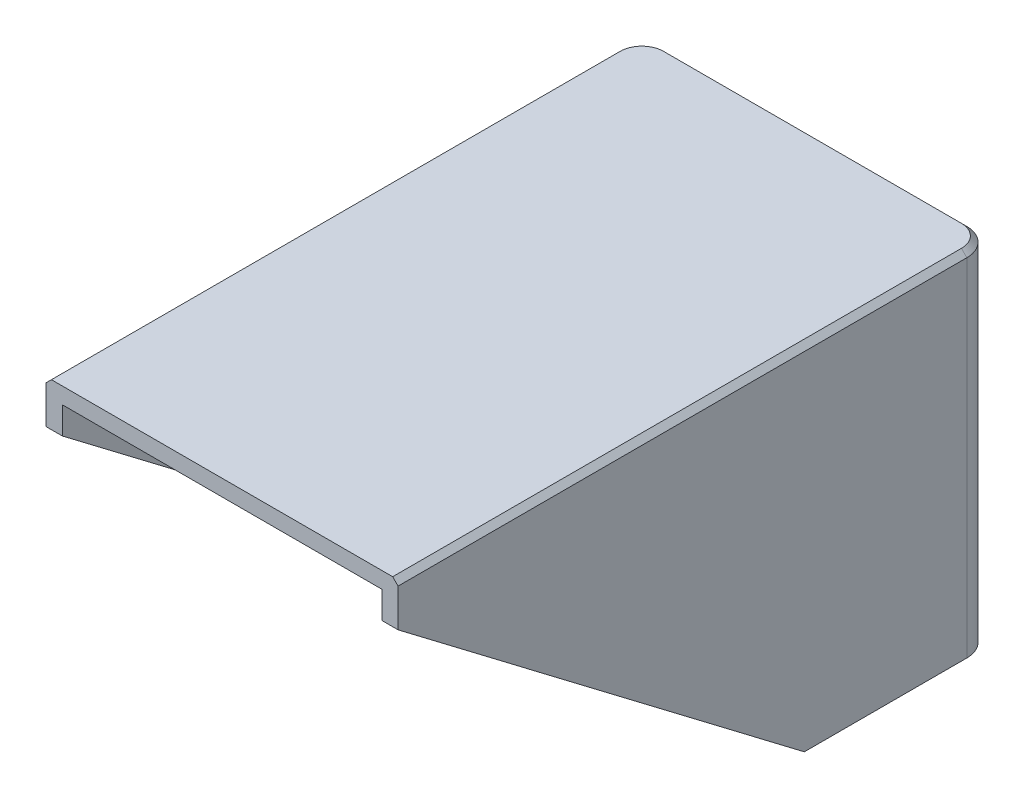
ISO-10303-21;
HEADER;
FILE_DESCRIPTION(('STEP AP214'),'2;1');
FILE_NAME('part.step','',(''),(''),'','','');
FILE_SCHEMA(('AUTOMOTIVE_DESIGN { 1 0 10303 214 1 1 1 1 }'));
ENDSEC;
DATA;
#1=APPLICATION_CONTEXT('core data for automotive mechanical design processes');
#2=APPLICATION_PROTOCOL_DEFINITION('international standard','automotive_design',2000,#1);
#3=PRODUCT_CONTEXT('',#1,'mechanical');
#4=PRODUCT('Part','Part','',(#3));
#5=PRODUCT_RELATED_PRODUCT_CATEGORY('part','',(#4));
#6=PRODUCT_DEFINITION_FORMATION('','',#4);
#7=PRODUCT_DEFINITION_CONTEXT('part definition',#1,'design');
#8=PRODUCT_DEFINITION('design','',#6,#7);
#9=PRODUCT_DEFINITION_SHAPE('','',#8);
#10=(LENGTH_UNIT() NAMED_UNIT(*) SI_UNIT(.MILLI.,.METRE.));
#11=(NAMED_UNIT(*) PLANE_ANGLE_UNIT() SI_UNIT($,.RADIAN.));
#12=(NAMED_UNIT(*) SI_UNIT($,.STERADIAN.) SOLID_ANGLE_UNIT());
#13=UNCERTAINTY_MEASURE_WITH_UNIT(LENGTH_MEASURE(1.E-05),#10,'distance_accuracy_value','');
#14=(GEOMETRIC_REPRESENTATION_CONTEXT(3) GLOBAL_UNCERTAINTY_ASSIGNED_CONTEXT((#13)) GLOBAL_UNIT_ASSIGNED_CONTEXT((#10,
#11,#12)) REPRESENTATION_CONTEXT('',''));
#15=CARTESIAN_POINT('',(0.,0.,0.));
#16=DIRECTION('',(0.,0.,1.));
#17=DIRECTION('',(1.,0.,0.));
#18=AXIS2_PLACEMENT_3D('',#15,#16,#17);
#19=CARTESIAN_POINT('',(0.,77.,0.));
#20=DIRECTION('',(0.,-1.,0.));
#21=DIRECTION('',(0.,0.,-1.));
#22=AXIS2_PLACEMENT_3D('',#19,#20,#21);
#23=PLANE('',#22);
#24=DIRECTION('',(-1.,0.,0.));
#25=VECTOR('',#24,1.);
#26=CARTESIAN_POINT('',(0.,77.,-59.5));
#27=LINE('',#26,#25);
#28=CARTESIAN_POINT('',(27.5,77.,-59.5));
#29=VERTEX_POINT('',#28);
#30=CARTESIAN_POINT('',(-27.5,77.,-59.5));
#31=VERTEX_POINT('',#30);
#32=EDGE_CURVE('E229',#29,#31,#27,.T.);
#33=ORIENTED_EDGE('',*,*,#32,.F.);
#34=CARTESIAN_POINT('',(27.5,77.,-57.5));
#35=DIRECTION('',(0.,-1.,0.));
#36=DIRECTION('',(0.,0.,-1.));
#37=AXIS2_PLACEMENT_3D('',#34,#35,#36);
#38=CIRCLE('',#37,2.);
#39=CARTESIAN_POINT('',(29.5,77.,-57.5));
#40=VERTEX_POINT('',#39);
#41=EDGE_CURVE('E264',#29,#40,#38,.T.);
#42=ORIENTED_EDGE('',*,*,#41,.T.);
#43=DIRECTION('',(0.,0.,-1.));
#44=VECTOR('',#43,1.);
#45=CARTESIAN_POINT('',(29.5,77.,0.));
#46=LINE('',#45,#44);
#47=CARTESIAN_POINT('',(29.5,77.,47.5));
#48=VERTEX_POINT('',#47);
#49=EDGE_CURVE('E226',#48,#40,#46,.T.);
#50=ORIENTED_EDGE('',*,*,#49,.F.);
#51=DIRECTION('',(-1.,0.,0.));
#52=VECTOR('',#51,1.);
#53=CARTESIAN_POINT('',(0.,77.,47.5));
#54=LINE('',#53,#52);
#55=CARTESIAN_POINT('',(-29.5,77.,47.5));
#56=VERTEX_POINT('',#55);
#57=EDGE_CURVE('E234',#48,#56,#54,.T.);
#58=ORIENTED_EDGE('',*,*,#57,.T.);
#59=DIRECTION('',(0.,0.,1.));
#60=VECTOR('',#59,1.);
#61=CARTESIAN_POINT('',(-29.5,77.,0.));
#62=LINE('',#61,#60);
#63=CARTESIAN_POINT('',(-29.5,77.,-57.5));
#64=VERTEX_POINT('',#63);
#65=EDGE_CURVE('E232',#64,#56,#62,.T.);
#66=ORIENTED_EDGE('',*,*,#65,.F.);
#67=CARTESIAN_POINT('',(-27.5,77.,-57.5));
#68=DIRECTION('',(0.,-1.,0.));
#69=DIRECTION('',(0.,0.,-1.));
#70=AXIS2_PLACEMENT_3D('',#67,#68,#69);
#71=CIRCLE('',#70,2.);
#72=EDGE_CURVE('E262',#64,#31,#71,.T.);
#73=ORIENTED_EDGE('',*,*,#72,.T.);
#74=EDGE_LOOP('',(#33,#42,#50,#58,#66,#73));
#75=FACE_BOUND('',#74,.T.);
#76=ADVANCED_FACE('F45',(#75),#23,.T.);
#77=CARTESIAN_POINT('',(-29.5,80.,62.5));
#78=DIRECTION('',(1.,0.,0.));
#79=DIRECTION('',(0.,0.,-1.));
#80=AXIS2_PLACEMENT_3D('',#77,#78,#79);
#81=PLANE('',#80);
#82=DIRECTION('',(0.,0.,-1.));
#83=VECTOR('',#82,1.);
#84=CARTESIAN_POINT('',(-29.5,15.,62.5));
#85=LINE('',#84,#83);
#86=CARTESIAN_POINT('',(-29.5,15.,-27.5));
#87=VERTEX_POINT('',#86);
#88=CARTESIAN_POINT('',(-29.5,15.,-57.5));
#89=VERTEX_POINT('',#88);
#90=EDGE_CURVE('E172',#87,#89,#85,.T.);
#91=ORIENTED_EDGE('',*,*,#90,.T.);
#92=DIRECTION('',(0.,-1.,0.));
#93=VECTOR('',#92,1.);
#94=CARTESIAN_POINT('',(-29.5,77.,-57.5));
#95=LINE('',#94,#93);
#96=EDGE_CURVE('E266',#89,#64,#95,.F.);
#97=ORIENTED_EDGE('',*,*,#96,.T.);
#98=ORIENTED_EDGE('',*,*,#65,.T.);
#99=DIRECTION('',(0.,-1.,0.));
#100=VECTOR('',#99,1.);
#101=CARTESIAN_POINT('',(-29.5,80.,47.5));
#102=LINE('',#101,#100);
#103=CARTESIAN_POINT('',(-29.5,72.,47.5));
#104=VERTEX_POINT('',#103);
#105=EDGE_CURVE('E209',#56,#104,#102,.T.);
#106=ORIENTED_EDGE('',*,*,#105,.T.);
#107=DIRECTION('',(0.,-0.605083267533558,-0.796162194123103));
#108=VECTOR('',#107,1.);
#109=CARTESIAN_POINT('',(-29.5,82.1551724137931,60.8620689655172));
#110=LINE('',#109,#108);
#111=EDGE_CURVE('E237',#104,#87,#110,.T.);
#112=ORIENTED_EDGE('',*,*,#111,.T.);
#113=EDGE_LOOP('',(#91,#97,#98,#106,#112));
#114=FACE_BOUND('',#113,.T.);
#115=ADVANCED_FACE('F374',(#114),#81,.T.);
#116=CARTESIAN_POINT('',(-32.5,80.,-59.5));
#117=DIRECTION('',(0.,0.,1.));
#118=DIRECTION('',(1.,0.,0.));
#119=AXIS2_PLACEMENT_3D('',#116,#117,#118);
#120=PLANE('',#119);
#121=DIRECTION('',(1.,0.,0.));
#122=VECTOR('',#121,1.);
#123=CARTESIAN_POINT('',(-32.5,15.,-59.5));
#124=LINE('',#123,#122);
#125=CARTESIAN_POINT('',(-27.5,15.,-59.5));
#126=VERTEX_POINT('',#125);
#127=CARTESIAN_POINT('',(27.5,15.,-59.5));
#128=VERTEX_POINT('',#127);
#129=EDGE_CURVE('E221',#126,#128,#124,.T.);
#130=ORIENTED_EDGE('',*,*,#129,.T.);
#131=DIRECTION('',(0.,-1.,0.));
#132=VECTOR('',#131,1.);
#133=CARTESIAN_POINT('',(27.5,77.,-59.5));
#134=LINE('',#133,#132);
#135=EDGE_CURVE('E260',#128,#29,#134,.F.);
#136=ORIENTED_EDGE('',*,*,#135,.T.);
#137=ORIENTED_EDGE('',*,*,#32,.T.);
#138=DIRECTION('',(0.,-1.,0.));
#139=VECTOR('',#138,1.);
#140=CARTESIAN_POINT('',(-27.5,15.,-59.5));
#141=LINE('',#140,#139);
#142=EDGE_CURVE('E256',#31,#126,#141,.T.);
#143=ORIENTED_EDGE('',*,*,#142,.T.);
#144=EDGE_LOOP('',(#130,#136,#137,#143));
#145=FACE_BOUND('',#144,.T.);
#146=ADVANCED_FACE('F380',(#145),#120,.T.);
#147=CARTESIAN_POINT('',(29.5,80.,62.5));
#148=DIRECTION('',(-1.,0.,0.));
#149=DIRECTION('',(0.,0.,1.));
#150=AXIS2_PLACEMENT_3D('',#147,#148,#149);
#151=PLANE('',#150);
#152=ORIENTED_EDGE('',*,*,#49,.T.);
#153=DIRECTION('',(0.,-1.,0.));
#154=VECTOR('',#153,1.);
#155=CARTESIAN_POINT('',(29.5,15.,-57.5));
#156=LINE('',#155,#154);
#157=CARTESIAN_POINT('',(29.5,15.,-57.5));
#158=VERTEX_POINT('',#157);
#159=EDGE_CURVE('E253',#40,#158,#156,.T.);
#160=ORIENTED_EDGE('',*,*,#159,.T.);
#161=DIRECTION('',(0.,0.,1.));
#162=VECTOR('',#161,1.);
#163=CARTESIAN_POINT('',(29.5,15.,62.5));
#164=LINE('',#163,#162);
#165=CARTESIAN_POINT('',(29.5,15.,-27.5));
#166=VERTEX_POINT('',#165);
#167=EDGE_CURVE('E224',#158,#166,#164,.T.);
#168=ORIENTED_EDGE('',*,*,#167,.T.);
#169=DIRECTION('',(0.,0.605083267533558,0.796162194123103));
#170=VECTOR('',#169,1.);
#171=CARTESIAN_POINT('',(29.5,82.1551724137931,60.8620689655172));
#172=LINE('',#171,#170);
#173=CARTESIAN_POINT('',(29.5,72.,47.5));
#174=VERTEX_POINT('',#173);
#175=EDGE_CURVE('E217',#166,#174,#172,.T.);
#176=ORIENTED_EDGE('',*,*,#175,.T.);
#177=DIRECTION('',(0.,1.,0.));
#178=VECTOR('',#177,1.);
#179=CARTESIAN_POINT('',(29.5,80.,47.5));
#180=LINE('',#179,#178);
#181=EDGE_CURVE('E214',#174,#48,#180,.T.);
#182=ORIENTED_EDGE('',*,*,#181,.T.);
#183=EDGE_LOOP('',(#152,#160,#168,#176,#182));
#184=FACE_BOUND('',#183,.T.);
#185=ADVANCED_FACE('F532',(#184),#151,.T.);
#186=CARTESIAN_POINT('',(-32.5,72.,47.5));
#187=DIRECTION('',(0.,-0.796162194123103,0.605083267533558));
#188=DIRECTION('',(0.,-0.605083267533558,-0.796162194123103));
#189=AXIS2_PLACEMENT_3D('',#186,#187,#188);
#190=PLANE('',#189);
#191=DIRECTION('',(1.,0.,0.));
#192=VECTOR('',#191,1.);
#193=CARTESIAN_POINT('',(-32.5,15.,-27.5));
#194=LINE('',#193,#192);
#195=CARTESIAN_POINT('',(32.5,15.,-27.5));
#196=VERTEX_POINT('',#195);
#197=EDGE_CURVE('E176',#166,#196,#194,.T.);
#198=ORIENTED_EDGE('',*,*,#197,.T.);
#199=DIRECTION('',(0.,-0.605083267533558,-0.796162194123103));
#200=VECTOR('',#199,1.);
#201=CARTESIAN_POINT('',(32.5,72.,47.5));
#202=LINE('',#201,#200);
#203=CARTESIAN_POINT('',(32.5,72.,47.5));
#204=VERTEX_POINT('',#203);
#205=EDGE_CURVE('E201',#204,#196,#202,.T.);
#206=ORIENTED_EDGE('',*,*,#205,.F.);
#207=DIRECTION('',(1.,0.,0.));
#208=VECTOR('',#207,1.);
#209=CARTESIAN_POINT('',(-32.5,72.,47.5));
#210=LINE('',#209,#208);
#211=EDGE_CURVE('E195',#174,#204,#210,.T.);
#212=ORIENTED_EDGE('',*,*,#211,.F.);
#213=ORIENTED_EDGE('',*,*,#175,.F.);
#214=EDGE_LOOP('',(#198,#206,#212,#213));
#215=FACE_BOUND('',#214,.T.);
#216=ADVANCED_FACE('F326',(#215),#190,.T.);
#217=CARTESIAN_POINT('',(-32.5,15.,-27.5));
#218=DIRECTION('',(0.,-1.,0.));
#219=DIRECTION('',(0.,0.,-1.));
#220=AXIS2_PLACEMENT_3D('',#217,#218,#219);
#221=PLANE('',#220);
#222=DIRECTION('',(0.,0.,-1.));
#223=VECTOR('',#222,1.);
#224=CARTESIAN_POINT('',(-32.5,15.,-27.5));
#225=LINE('',#224,#223);
#226=CARTESIAN_POINT('',(-32.5,15.,-27.5));
#227=VERTEX_POINT('',#226);
#228=CARTESIAN_POINT('',(-32.5,15.,-57.5));
#229=VERTEX_POINT('',#228);
#230=EDGE_CURVE('E170',#227,#229,#225,.T.);
#231=ORIENTED_EDGE('',*,*,#230,.T.);
#232=CARTESIAN_POINT('',(-27.5,15.,-57.5));
#233=DIRECTION('',(0.,-1.,0.));
#234=DIRECTION('',(0.,0.,-1.));
#235=AXIS2_PLACEMENT_3D('',#232,#233,#234);
#236=CIRCLE('',#235,5.);
#237=CARTESIAN_POINT('',(-27.5,15.,-62.5));
#238=VERTEX_POINT('',#237);
#239=EDGE_CURVE('E244',#229,#238,#236,.T.);
#240=ORIENTED_EDGE('',*,*,#239,.T.);
#241=DIRECTION('',(1.,0.,0.));
#242=VECTOR('',#241,1.);
#243=CARTESIAN_POINT('',(-32.5,15.,-62.5));
#244=LINE('',#243,#242);
#245=CARTESIAN_POINT('',(27.5,15.,-62.5));
#246=VERTEX_POINT('',#245);
#247=EDGE_CURVE('E175',#238,#246,#244,.T.);
#248=ORIENTED_EDGE('',*,*,#247,.T.);
#249=CARTESIAN_POINT('',(27.5,15.,-57.5));
#250=DIRECTION('',(0.,-1.,0.));
#251=DIRECTION('',(0.,0.,-1.));
#252=AXIS2_PLACEMENT_3D('',#249,#250,#251);
#253=CIRCLE('',#252,5.);
#254=CARTESIAN_POINT('',(32.5,15.,-57.5));
#255=VERTEX_POINT('',#254);
#256=EDGE_CURVE('E242',#246,#255,#253,.T.);
#257=ORIENTED_EDGE('',*,*,#256,.T.);
#258=DIRECTION('',(0.,0.,-1.));
#259=VECTOR('',#258,1.);
#260=CARTESIAN_POINT('',(32.5,15.,-27.5));
#261=LINE('',#260,#259);
#262=EDGE_CURVE('E205',#196,#255,#261,.T.);
#263=ORIENTED_EDGE('',*,*,#262,.F.);
#264=ORIENTED_EDGE('',*,*,#197,.F.);
#265=ORIENTED_EDGE('',*,*,#167,.F.);
#266=CARTESIAN_POINT('',(27.5,15.,-57.5));
#267=DIRECTION('',(0.,-1.,0.));
#268=DIRECTION('',(0.,0.,-1.));
#269=AXIS2_PLACEMENT_3D('',#266,#267,#268);
#270=CIRCLE('',#269,2.);
#271=EDGE_CURVE('E269',#158,#128,#270,.F.);
#272=ORIENTED_EDGE('',*,*,#271,.T.);
#273=ORIENTED_EDGE('',*,*,#129,.F.);
#274=CARTESIAN_POINT('',(-27.5,15.,-57.5));
#275=DIRECTION('',(0.,-1.,0.));
#276=DIRECTION('',(0.,0.,-1.));
#277=AXIS2_PLACEMENT_3D('',#274,#275,#276);
#278=CIRCLE('',#277,2.);
#279=EDGE_CURVE('E271',#126,#89,#278,.F.);
#280=ORIENTED_EDGE('',*,*,#279,.T.);
#281=ORIENTED_EDGE('',*,*,#90,.F.);
#282=EDGE_CURVE('E166',#227,#87,#194,.T.);
#283=ORIENTED_EDGE('',*,*,#282,.F.);
#284=EDGE_LOOP('',(#231,#240,#248,#257,#263,#264,#265,#272,#273,#280,#281,#283));
#285=FACE_BOUND('',#284,.T.);
#286=ADVANCED_FACE('F168',(#285),#221,.T.);
#287=CARTESIAN_POINT('',(-32.5,72.,47.5));
#288=VERTEX_POINT('',#287);
#289=EDGE_CURVE('E183',#288,#104,#210,.T.);
#290=ORIENTED_EDGE('',*,*,#289,.F.);
#291=DIRECTION('',(0.,-0.605083267533558,-0.796162194123103));
#292=VECTOR('',#291,1.);
#293=CARTESIAN_POINT('',(-32.5,72.,47.5));
#294=LINE('',#293,#292);
#295=EDGE_CURVE('E180',#288,#227,#294,.T.);
#296=ORIENTED_EDGE('',*,*,#295,.T.);
#297=ORIENTED_EDGE('',*,*,#282,.T.);
#298=ORIENTED_EDGE('',*,*,#111,.F.);
#299=EDGE_LOOP('',(#290,#296,#297,#298));
#300=FACE_BOUND('',#299,.T.);
#301=ADVANCED_FACE('F181',(#300),#190,.T.);
#302=CARTESIAN_POINT('',(-32.5,80.,47.5));
#303=DIRECTION('',(0.,0.,1.));
#304=DIRECTION('',(0.,-1.,0.));
#305=AXIS2_PLACEMENT_3D('',#302,#303,#304);
#306=PLANE('',#305);
#307=DIRECTION('',(1.,0.,0.));
#308=VECTOR('',#307,1.);
#309=CARTESIAN_POINT('',(-32.5,80.,47.5));
#310=LINE('',#309,#308);
#311=CARTESIAN_POINT('',(-31.5,80.,47.5));
#312=VERTEX_POINT('',#311);
#313=CARTESIAN_POINT('',(31.5,80.,47.5));
#314=VERTEX_POINT('',#313);
#315=EDGE_CURVE('E192',#312,#314,#310,.T.);
#316=ORIENTED_EDGE('',*,*,#315,.F.);
#317=DIRECTION('',(0.70710678118655,0.707106781186545,0.));
#318=VECTOR('',#317,1.);
#319=CARTESIAN_POINT('',(-32.,79.5,47.5));
#320=LINE('',#319,#318);
#321=CARTESIAN_POINT('',(-32.5,79.,47.5));
#322=VERTEX_POINT('',#321);
#323=EDGE_CURVE('E286',#312,#322,#320,.F.);
#324=ORIENTED_EDGE('',*,*,#323,.T.);
#325=DIRECTION('',(0.,-1.,0.));
#326=VECTOR('',#325,1.);
#327=CARTESIAN_POINT('',(-32.5,80.,47.5));
#328=LINE('',#327,#326);
#329=EDGE_CURVE('E186',#322,#288,#328,.T.);
#330=ORIENTED_EDGE('',*,*,#329,.T.);
#331=ORIENTED_EDGE('',*,*,#289,.T.);
#332=ORIENTED_EDGE('',*,*,#105,.F.);
#333=ORIENTED_EDGE('',*,*,#57,.F.);
#334=ORIENTED_EDGE('',*,*,#181,.F.);
#335=ORIENTED_EDGE('',*,*,#211,.T.);
#336=DIRECTION('',(0.,-1.,0.));
#337=VECTOR('',#336,1.);
#338=CARTESIAN_POINT('',(32.5,80.,47.5));
#339=LINE('',#338,#337);
#340=CARTESIAN_POINT('',(32.5,79.,47.5));
#341=VERTEX_POINT('',#340);
#342=EDGE_CURVE('E199',#341,#204,#339,.T.);
#343=ORIENTED_EDGE('',*,*,#342,.F.);
#344=DIRECTION('',(0.70710678118655,-0.707106781186545,0.));
#345=VECTOR('',#344,1.);
#346=CARTESIAN_POINT('',(-0.500000000000229,112.,47.5));
#347=LINE('',#346,#345);
#348=EDGE_CURVE('E284',#341,#314,#347,.F.);
#349=ORIENTED_EDGE('',*,*,#348,.T.);
#350=EDGE_LOOP('',(#316,#324,#330,#331,#332,#333,#334,#335,#343,#349));
#351=FACE_BOUND('',#350,.T.);
#352=ADVANCED_FACE('F321',(#351),#306,.T.);
#353=CARTESIAN_POINT('',(32.5,80.,62.5));
#354=DIRECTION('',(-1.,0.,0.));
#355=DIRECTION('',(0.,0.,1.));
#356=AXIS2_PLACEMENT_3D('',#353,#354,#355);
#357=PLANE('',#356);
#358=DIRECTION('',(0.,-1.,0.));
#359=VECTOR('',#358,1.);
#360=CARTESIAN_POINT('',(32.5,80.,-57.5));
#361=LINE('',#360,#359);
#362=CARTESIAN_POINT('',(32.5,79.,-57.5));
#363=VERTEX_POINT('',#362);
#364=EDGE_CURVE('E251',#255,#363,#361,.F.);
#365=ORIENTED_EDGE('',*,*,#364,.T.);
#366=DIRECTION('',(0.,0.,1.));
#367=VECTOR('',#366,1.);
#368=CARTESIAN_POINT('',(32.5,79.,62.5));
#369=LINE('',#368,#367);
#370=EDGE_CURVE('E292',#363,#341,#369,.T.);
#371=ORIENTED_EDGE('',*,*,#370,.T.);
#372=ORIENTED_EDGE('',*,*,#342,.T.);
#373=ORIENTED_EDGE('',*,*,#205,.T.);
#374=ORIENTED_EDGE('',*,*,#262,.T.);
#375=EDGE_LOOP('',(#365,#371,#372,#373,#374));
#376=FACE_BOUND('',#375,.T.);
#377=ADVANCED_FACE('F317',(#376),#357,.F.);
#378=CARTESIAN_POINT('',(-32.5,80.,-62.5));
#379=DIRECTION('',(0.,0.,1.));
#380=DIRECTION('',(1.,0.,0.));
#381=AXIS2_PLACEMENT_3D('',#378,#379,#380);
#382=PLANE('',#381);
#383=CARTESIAN_POINT('',(0.,55.,-62.5));
#384=DIRECTION('',(0.,0.,-1.));
#385=DIRECTION('',(-1.,0.,0.));
#386=AXIS2_PLACEMENT_3D('',#383,#384,#385);
#387=CIRCLE('',#386,15.24);
#388=CARTESIAN_POINT('',(-15.24,55.,-62.5));
#389=VERTEX_POINT('',#388);
#390=EDGE_CURVE('E349',#389,#389,#387,.T.);
#391=ORIENTED_EDGE('',*,*,#390,.F.);
#392=EDGE_LOOP('',(#391));
#393=FACE_BOUND('',#392,.T.);
#394=DIRECTION('',(0.,-1.,0.));
#395=VECTOR('',#394,1.);
#396=CARTESIAN_POINT('',(-27.5,80.,-62.5));
#397=LINE('',#396,#395);
#398=CARTESIAN_POINT('',(-27.5,79.,-62.5));
#399=VERTEX_POINT('',#398);
#400=EDGE_CURVE('E248',#238,#399,#397,.F.);
#401=ORIENTED_EDGE('',*,*,#400,.T.);
#402=DIRECTION('',(1.,0.,0.));
#403=VECTOR('',#402,1.);
#404=CARTESIAN_POINT('',(-32.5,79.,-62.5));
#405=LINE('',#404,#403);
#406=CARTESIAN_POINT('',(27.5,79.,-62.5));
#407=VERTEX_POINT('',#406);
#408=EDGE_CURVE('E55',#399,#407,#405,.T.);
#409=ORIENTED_EDGE('',*,*,#408,.T.);
#410=DIRECTION('',(0.,-1.,0.));
#411=VECTOR('',#410,1.);
#412=CARTESIAN_POINT('',(27.5,80.,-62.5));
#413=LINE('',#412,#411);
#414=EDGE_CURVE('E246',#407,#246,#413,.T.);
#415=ORIENTED_EDGE('',*,*,#414,.T.);
#416=ORIENTED_EDGE('',*,*,#247,.F.);
#417=EDGE_LOOP('',(#401,#409,#415,#416));
#418=FACE_BOUND('',#417,.T.);
#419=ADVANCED_FACE('F333',(#393,#418),#382,.F.);
#420=CARTESIAN_POINT('',(-32.5,80.,62.5));
#421=DIRECTION('',(1.,0.,0.));
#422=DIRECTION('',(0.,0.,-1.));
#423=AXIS2_PLACEMENT_3D('',#420,#421,#422);
#424=PLANE('',#423);
#425=ORIENTED_EDGE('',*,*,#329,.F.);
#426=DIRECTION('',(0.,0.,-1.));
#427=VECTOR('',#426,1.);
#428=CARTESIAN_POINT('',(-32.5,79.,62.5));
#429=LINE('',#428,#427);
#430=CARTESIAN_POINT('',(-32.5,79.,-57.5));
#431=VERTEX_POINT('',#430);
#432=EDGE_CURVE('E288',#322,#431,#429,.T.);
#433=ORIENTED_EDGE('',*,*,#432,.T.);
#434=DIRECTION('',(0.,-1.,0.));
#435=VECTOR('',#434,1.);
#436=CARTESIAN_POINT('',(-32.5,80.,-57.5));
#437=LINE('',#436,#435);
#438=EDGE_CURVE('E190',#431,#229,#437,.T.);
#439=ORIENTED_EDGE('',*,*,#438,.T.);
#440=ORIENTED_EDGE('',*,*,#230,.F.);
#441=ORIENTED_EDGE('',*,*,#295,.F.);
#442=EDGE_LOOP('',(#425,#433,#439,#440,#441));
#443=FACE_BOUND('',#442,.T.);
#444=ADVANCED_FACE('F188',(#443),#424,.F.);
#445=CARTESIAN_POINT('',(0.,80.,0.));
#446=DIRECTION('',(0.,-1.,0.));
#447=DIRECTION('',(0.,0.,-1.));
#448=AXIS2_PLACEMENT_3D('',#445,#446,#447);
#449=PLANE('',#448);
#450=CARTESIAN_POINT('',(-27.5,80.,-57.5));
#451=DIRECTION('',(0.,-1.,0.));
#452=DIRECTION('',(0.,0.,-1.));
#453=AXIS2_PLACEMENT_3D('',#450,#451,#452);
#454=CIRCLE('',#453,4.00000000000001);
#455=CARTESIAN_POINT('',(-27.5,80.,-61.5));
#456=VERTEX_POINT('',#455);
#457=CARTESIAN_POINT('',(-31.5,80.,-57.5));
#458=VERTEX_POINT('',#457);
#459=EDGE_CURVE('E279',#456,#458,#454,.F.);
#460=ORIENTED_EDGE('',*,*,#459,.T.);
#461=DIRECTION('',(0.,0.,1.));
#462=VECTOR('',#461,1.);
#463=CARTESIAN_POINT('',(-31.5,80.,0.));
#464=LINE('',#463,#462);
#465=EDGE_CURVE('E281',#458,#312,#464,.T.);
#466=ORIENTED_EDGE('',*,*,#465,.T.);
#467=ORIENTED_EDGE('',*,*,#315,.T.);
#468=DIRECTION('',(0.,0.,-1.));
#469=VECTOR('',#468,1.);
#470=CARTESIAN_POINT('',(31.5,80.,0.));
#471=LINE('',#470,#469);
#472=CARTESIAN_POINT('',(31.5,80.,-57.5));
#473=VERTEX_POINT('',#472);
#474=EDGE_CURVE('E277',#314,#473,#471,.T.);
#475=ORIENTED_EDGE('',*,*,#474,.T.);
#476=CARTESIAN_POINT('',(27.5,80.,-57.5));
#477=DIRECTION('',(0.,-1.,0.));
#478=DIRECTION('',(0.,0.,-1.));
#479=AXIS2_PLACEMENT_3D('',#476,#477,#478);
#480=CIRCLE('',#479,4.);
#481=CARTESIAN_POINT('',(27.5,80.,-61.5));
#482=VERTEX_POINT('',#481);
#483=EDGE_CURVE('E273',#473,#482,#480,.F.);
#484=ORIENTED_EDGE('',*,*,#483,.T.);
#485=DIRECTION('',(-1.,0.,0.));
#486=VECTOR('',#485,1.);
#487=CARTESIAN_POINT('',(0.,80.,-61.5));
#488=LINE('',#487,#486);
#489=EDGE_CURVE('E275',#482,#456,#488,.T.);
#490=ORIENTED_EDGE('',*,*,#489,.T.);
#491=EDGE_LOOP('',(#460,#466,#467,#475,#484,#490));
#492=FACE_BOUND('',#491,.T.);
#493=ADVANCED_FACE('F347',(#492),#449,.F.);
#494=CARTESIAN_POINT('',(-27.5,80.,-57.5));
#495=DIRECTION('',(0.,-1.,0.));
#496=DIRECTION('',(0.,0.,-1.));
#497=AXIS2_PLACEMENT_3D('',#494,#495,#496);
#498=CYLINDRICAL_SURFACE('',#497,5.);
#499=ORIENTED_EDGE('',*,*,#438,.F.);
#500=CARTESIAN_POINT('',(-27.5,79.,-57.5));
#501=DIRECTION('',(0.,-1.,0.));
#502=DIRECTION('',(0.,0.,-1.));
#503=AXIS2_PLACEMENT_3D('',#500,#501,#502);
#504=CIRCLE('',#503,5.);
#505=EDGE_CURVE('E290',#431,#399,#504,.T.);
#506=ORIENTED_EDGE('',*,*,#505,.T.);
#507=ORIENTED_EDGE('',*,*,#400,.F.);
#508=ORIENTED_EDGE('',*,*,#239,.F.);
#509=EDGE_LOOP('',(#499,#506,#507,#508));
#510=FACE_BOUND('',#509,.T.);
#511=ADVANCED_FACE('F335',(#510),#498,.T.);
#512=CARTESIAN_POINT('',(27.5,80.,-57.5));
#513=DIRECTION('',(0.,-1.,0.));
#514=DIRECTION('',(0.,0.,-1.));
#515=AXIS2_PLACEMENT_3D('',#512,#513,#514);
#516=CYLINDRICAL_SURFACE('',#515,5.);
#517=ORIENTED_EDGE('',*,*,#414,.F.);
#518=CARTESIAN_POINT('',(27.5,79.,-57.5));
#519=DIRECTION('',(0.,-1.,0.));
#520=DIRECTION('',(0.,0.,-1.));
#521=AXIS2_PLACEMENT_3D('',#518,#519,#520);
#522=CIRCLE('',#521,5.);
#523=EDGE_CURVE('E12',#407,#363,#522,.T.);
#524=ORIENTED_EDGE('',*,*,#523,.T.);
#525=ORIENTED_EDGE('',*,*,#364,.F.);
#526=ORIENTED_EDGE('',*,*,#256,.F.);
#527=EDGE_LOOP('',(#517,#524,#525,#526));
#528=FACE_BOUND('',#527,.T.);
#529=ADVANCED_FACE('F330',(#528),#516,.T.);
#530=CARTESIAN_POINT('',(27.5,80.,-57.5));
#531=DIRECTION('',(0.,1.,0.));
#532=DIRECTION('',(0.,0.,1.));
#533=AXIS2_PLACEMENT_3D('',#530,#531,#532);
#534=CYLINDRICAL_SURFACE('',#533,2.);
#535=ORIENTED_EDGE('',*,*,#41,.F.);
#536=ORIENTED_EDGE('',*,*,#135,.F.);
#537=ORIENTED_EDGE('',*,*,#271,.F.);
#538=ORIENTED_EDGE('',*,*,#159,.F.);
#539=EDGE_LOOP('',(#535,#536,#537,#538));
#540=FACE_BOUND('',#539,.T.);
#541=ADVANCED_FACE('F394',(#540),#534,.F.);
#542=CARTESIAN_POINT('',(-27.5,80.,-57.5));
#543=DIRECTION('',(0.,1.,0.));
#544=DIRECTION('',(0.,0.,1.));
#545=AXIS2_PLACEMENT_3D('',#542,#543,#544);
#546=CYLINDRICAL_SURFACE('',#545,2.);
#547=ORIENTED_EDGE('',*,*,#72,.F.);
#548=ORIENTED_EDGE('',*,*,#96,.F.);
#549=ORIENTED_EDGE('',*,*,#279,.F.);
#550=ORIENTED_EDGE('',*,*,#142,.F.);
#551=EDGE_LOOP('',(#547,#548,#549,#550));
#552=FACE_BOUND('',#551,.T.);
#553=ADVANCED_FACE('F399',(#552),#546,.F.);
#554=CARTESIAN_POINT('',(31.5,80.,0.));
#555=DIRECTION('',(-0.707106781186545,-0.70710678118655,0.));
#556=DIRECTION('',(0.,0.,-1.));
#557=AXIS2_PLACEMENT_3D('',#554,#555,#556);
#558=PLANE('',#557);
#559=ORIENTED_EDGE('',*,*,#348,.F.);
#560=ORIENTED_EDGE('',*,*,#370,.F.);
#561=DIRECTION('',(0.70710678118655,-0.707106781186545,0.));
#562=VECTOR('',#561,1.);
#563=CARTESIAN_POINT('',(31.5,80.,-57.5));
#564=LINE('',#563,#562);
#565=EDGE_CURVE('E50',#473,#363,#564,.T.);
#566=ORIENTED_EDGE('',*,*,#565,.F.);
#567=ORIENTED_EDGE('',*,*,#474,.F.);
#568=EDGE_LOOP('',(#559,#560,#566,#567));
#569=FACE_BOUND('',#568,.T.);
#570=ADVANCED_FACE('F48',(#569),#558,.F.);
#571=CARTESIAN_POINT('',(27.5,80.,-57.5));
#572=DIRECTION('',(0.,-1.,0.));
#573=DIRECTION('',(0.,0.,-1.));
#574=AXIS2_PLACEMENT_3D('',#571,#572,#573);
#575=CONICAL_SURFACE('',#574,4.,0.785398163397453);
#576=ORIENTED_EDGE('',*,*,#565,.T.);
#577=ORIENTED_EDGE('',*,*,#523,.F.);
#578=DIRECTION('',(0.,-0.707106781186545,-0.70710678118655));
#579=VECTOR('',#578,1.);
#580=CARTESIAN_POINT('',(27.5,80.,-61.5));
#581=LINE('',#580,#579);
#582=EDGE_CURVE('E301',#482,#407,#581,.T.);
#583=ORIENTED_EDGE('',*,*,#582,.F.);
#584=ORIENTED_EDGE('',*,*,#483,.F.);
#585=EDGE_LOOP('',(#576,#577,#583,#584));
#586=FACE_BOUND('',#585,.T.);
#587=ADVANCED_FACE('F310',(#586),#575,.T.);
#588=CARTESIAN_POINT('',(0.,80.,-61.5));
#589=DIRECTION('',(0.,-0.70710678118655,0.707106781186545));
#590=DIRECTION('',(-1.,0.,0.));
#591=AXIS2_PLACEMENT_3D('',#588,#589,#590);
#592=PLANE('',#591);
#593=ORIENTED_EDGE('',*,*,#582,.T.);
#594=ORIENTED_EDGE('',*,*,#408,.F.);
#595=DIRECTION('',(0.,-0.707106781186545,-0.70710678118655));
#596=VECTOR('',#595,1.);
#597=CARTESIAN_POINT('',(-27.5,80.,-61.5));
#598=LINE('',#597,#596);
#599=EDGE_CURVE('E298',#456,#399,#598,.T.);
#600=ORIENTED_EDGE('',*,*,#599,.F.);
#601=ORIENTED_EDGE('',*,*,#489,.F.);
#602=EDGE_LOOP('',(#593,#594,#600,#601));
#603=FACE_BOUND('',#602,.T.);
#604=ADVANCED_FACE('F415',(#603),#592,.F.);
#605=CARTESIAN_POINT('',(-27.5,80.,-57.5));
#606=DIRECTION('',(0.,-1.,0.));
#607=DIRECTION('',(0.,0.,-1.));
#608=AXIS2_PLACEMENT_3D('',#605,#606,#607);
#609=CONICAL_SURFACE('',#608,4.00000000000001,0.785398163397451);
#610=ORIENTED_EDGE('',*,*,#599,.T.);
#611=ORIENTED_EDGE('',*,*,#505,.F.);
#612=DIRECTION('',(-0.70710678118655,-0.707106781186545,0.));
#613=VECTOR('',#612,1.);
#614=CARTESIAN_POINT('',(-31.5,80.,-57.5));
#615=LINE('',#614,#613);
#616=EDGE_CURVE('E295',#458,#431,#615,.T.);
#617=ORIENTED_EDGE('',*,*,#616,.F.);
#618=ORIENTED_EDGE('',*,*,#459,.F.);
#619=EDGE_LOOP('',(#610,#611,#617,#618));
#620=FACE_BOUND('',#619,.T.);
#621=ADVANCED_FACE('F339',(#620),#609,.T.);
#622=CARTESIAN_POINT('',(-31.5,80.,0.));
#623=DIRECTION('',(0.707106781186545,-0.70710678118655,0.));
#624=DIRECTION('',(0.,0.,1.));
#625=AXIS2_PLACEMENT_3D('',#622,#623,#624);
#626=PLANE('',#625);
#627=ORIENTED_EDGE('',*,*,#616,.T.);
#628=ORIENTED_EDGE('',*,*,#432,.F.);
#629=ORIENTED_EDGE('',*,*,#323,.F.);
#630=ORIENTED_EDGE('',*,*,#465,.F.);
#631=EDGE_LOOP('',(#627,#628,#629,#630));
#632=FACE_BOUND('',#631,.T.);
#633=ADVANCED_FACE('F345',(#632),#626,.F.);
#634=CARTESIAN_POINT('',(0.,55.,-62.4));
#635=DIRECTION('',(0.,0.,-1.));
#636=DIRECTION('',(-1.,0.,0.));
#637=AXIS2_PLACEMENT_3D('',#634,#635,#636);
#638=CYLINDRICAL_SURFACE('',#637,15.24);
#639=CARTESIAN_POINT('',(0.,55.,-62.4));
#640=DIRECTION('',(0.,0.,-1.));
#641=DIRECTION('',(-1.,0.,0.));
#642=AXIS2_PLACEMENT_3D('',#639,#640,#641);
#643=CIRCLE('',#642,15.24);
#644=CARTESIAN_POINT('',(-15.24,55.,-62.4));
#645=VERTEX_POINT('',#644);
#646=EDGE_CURVE('E299',#645,#645,#643,.T.);
#647=ORIENTED_EDGE('',*,*,#646,.F.);
#648=EDGE_LOOP('',(#647));
#649=FACE_BOUND('',#648,.T.);
#650=ORIENTED_EDGE('',*,*,#390,.T.);
#651=EDGE_LOOP('',(#650));
#652=FACE_BOUND('',#651,.T.);
#653=ADVANCED_FACE('F359',(#649,#652),#638,.F.);
#654=CARTESIAN_POINT('',(0.,55.,-62.4));
#655=DIRECTION('',(0.,0.,-1.));
#656=DIRECTION('',(-1.,0.,0.));
#657=AXIS2_PLACEMENT_3D('',#654,#655,#656);
#658=PLANE('',#657);
#659=ORIENTED_EDGE('',*,*,#646,.T.);
#660=EDGE_LOOP('',(#659));
#661=FACE_BOUND('',#660,.T.);
#662=ADVANCED_FACE('F357',(#661),#658,.T.);
#663=CLOSED_SHELL('',(#76,#115,#146,#185,#216,#286,#301,#352,#377,#419,#444,#493,#511,#529,#541,
#553,#570,#587,#604,#621,#633,#653,#662));
#664=MANIFOLD_SOLID_BREP('B2',#663);
#665=ADVANCED_BREP_SHAPE_REPRESENTATION('',(#18,#664),#14);
#666=SHAPE_DEFINITION_REPRESENTATION(#9,#665);
ENDSEC;
END-ISO-10303-21;
